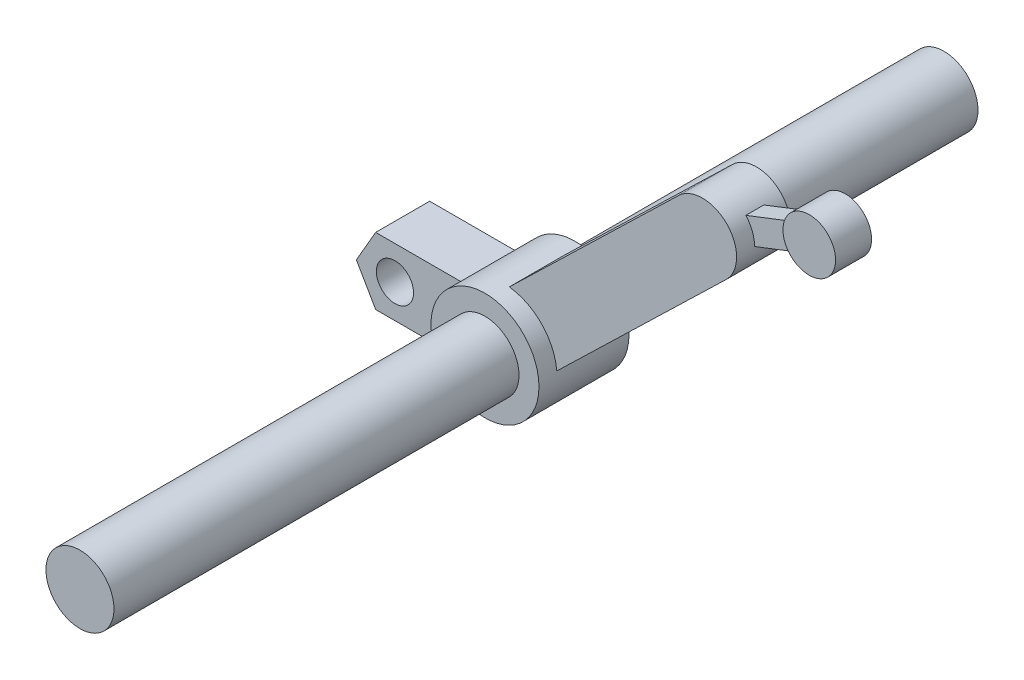
ISO-10303-21;
HEADER;
FILE_DESCRIPTION(('STEP AP214'),'2;1');
FILE_NAME('part.step','',(''),(''),'','','');
FILE_SCHEMA(('AUTOMOTIVE_DESIGN { 1 0 10303 214 1 1 1 1 }'));
ENDSEC;
DATA;
#1=APPLICATION_CONTEXT('core data for automotive mechanical design processes');
#2=APPLICATION_PROTOCOL_DEFINITION('international standard','automotive_design',2000,#1);
#3=PRODUCT_CONTEXT('',#1,'mechanical');
#4=PRODUCT('Part','Part','',(#3));
#5=PRODUCT_RELATED_PRODUCT_CATEGORY('part','',(#4));
#6=PRODUCT_DEFINITION_FORMATION('','',#4);
#7=PRODUCT_DEFINITION_CONTEXT('part definition',#1,'design');
#8=PRODUCT_DEFINITION('design','',#6,#7);
#9=PRODUCT_DEFINITION_SHAPE('','',#8);
#10=(LENGTH_UNIT() NAMED_UNIT(*) SI_UNIT(.MILLI.,.METRE.));
#11=(NAMED_UNIT(*) PLANE_ANGLE_UNIT() SI_UNIT($,.RADIAN.));
#12=(NAMED_UNIT(*) SI_UNIT($,.STERADIAN.) SOLID_ANGLE_UNIT());
#13=UNCERTAINTY_MEASURE_WITH_UNIT(LENGTH_MEASURE(1.E-05),#10,'distance_accuracy_value','');
#14=(GEOMETRIC_REPRESENTATION_CONTEXT(3) GLOBAL_UNCERTAINTY_ASSIGNED_CONTEXT((#13)) GLOBAL_UNIT_ASSIGNED_CONTEXT((#10,
#11,#12)) REPRESENTATION_CONTEXT('',''));
#15=CARTESIAN_POINT('',(0.,0.,0.));
#16=DIRECTION('',(0.,0.,1.));
#17=DIRECTION('',(1.,0.,0.));
#18=AXIS2_PLACEMENT_3D('',#15,#16,#17);
#19=CARTESIAN_POINT('',(11.3273441015259,10.0948459819858,23.5));
#20=DIRECTION('',(-0.361605144246385,0.93233133576779,0.));
#21=DIRECTION('',(-0.93233133576779,-0.361605144246385,0.));
#22=AXIS2_PLACEMENT_3D('',#19,#20,#21);
#23=PLANE('',#22);
#24=DIRECTION('',(0.,0.,-1.));
#25=VECTOR('',#24,1.);
#26=CARTESIAN_POINT('',(15.5503576142534,11.732743746268,24.));
#27=LINE('',#26,#25);
#28=CARTESIAN_POINT('',(15.5503576142534,11.732743746268,23.5));
#29=VERTEX_POINT('',#28);
#30=CARTESIAN_POINT('',(15.5503576142534,11.732743746268,22.5));
#31=VERTEX_POINT('',#30);
#32=EDGE_CURVE('E90',#29,#31,#27,.T.);
#33=ORIENTED_EDGE('',*,*,#32,.F.);
#34=DIRECTION('',(0.93233133576779,0.361605144246385,0.));
#35=VECTOR('',#34,1.);
#36=CARTESIAN_POINT('',(11.3273441015259,10.0948459819858,23.5));
#37=LINE('',#36,#35);
#38=CARTESIAN_POINT('',(12.9794699368657,10.7356237592438,23.5));
#39=VERTEX_POINT('',#38);
#40=EDGE_CURVE('E172',#39,#29,#37,.T.);
#41=ORIENTED_EDGE('',*,*,#40,.F.);
#42=DIRECTION('',(0.,0.,-1.));
#43=VECTOR('',#42,1.);
#44=CARTESIAN_POINT('',(12.9794699368657,10.7356237592438,24.5));
#45=LINE('',#44,#43);
#46=CARTESIAN_POINT('',(12.9794699368657,10.7356237592438,22.5));
#47=VERTEX_POINT('',#46);
#48=EDGE_CURVE('E282',#39,#47,#45,.T.);
#49=ORIENTED_EDGE('',*,*,#48,.T.);
#50=DIRECTION('',(0.93233133576779,0.361605144246385,0.));
#51=VECTOR('',#50,1.);
#52=CARTESIAN_POINT('',(11.3273441015259,10.0948459819858,22.5));
#53=LINE('',#52,#51);
#54=EDGE_CURVE('E173',#47,#31,#53,.T.);
#55=ORIENTED_EDGE('',*,*,#54,.T.);
#56=EDGE_LOOP('',(#33,#41,#49,#55));
#57=FACE_BOUND('',#56,.T.);
#58=ADVANCED_FACE('F66',(#57),#23,.F.);
#59=CARTESIAN_POINT('',(10.8401693064189,11.3509352127435,23.5));
#60=DIRECTION('',(-0.361605144246386,0.932331335767789,0.));
#61=DIRECTION('',(-0.93233133576779,-0.361605144246386,0.));
#62=AXIS2_PLACEMENT_3D('',#59,#60,#61);
#63=PLANE('',#62);
#64=DIRECTION('',(0.932331335767789,0.361605144246386,0.));
#65=VECTOR('',#64,1.);
#66=CARTESIAN_POINT('',(10.8401693064189,11.3509352127435,23.5));
#67=LINE('',#66,#65);
#68=CARTESIAN_POINT('',(12.4922951417588,11.9917129900015,23.5));
#69=VERTEX_POINT('',#68);
#70=CARTESIAN_POINT('',(15.0631828191465,12.9888329770257,23.5));
#71=VERTEX_POINT('',#70);
#72=EDGE_CURVE('E178',#69,#71,#67,.T.);
#73=ORIENTED_EDGE('',*,*,#72,.T.);
#74=DIRECTION('',(0.,0.,-1.));
#75=VECTOR('',#74,1.);
#76=CARTESIAN_POINT('',(15.0631828191465,12.9888329770257,24.));
#77=LINE('',#76,#75);
#78=CARTESIAN_POINT('',(15.0631828191465,12.9888329770257,22.5));
#79=VERTEX_POINT('',#78);
#80=EDGE_CURVE('E176',#71,#79,#77,.T.);
#81=ORIENTED_EDGE('',*,*,#80,.T.);
#82=DIRECTION('',(0.932331335767789,0.361605144246386,0.));
#83=VECTOR('',#82,1.);
#84=CARTESIAN_POINT('',(10.8401693064189,11.3509352127435,22.5));
#85=LINE('',#84,#83);
#86=CARTESIAN_POINT('',(12.4922951417588,11.9917129900015,22.5));
#87=VERTEX_POINT('',#86);
#88=EDGE_CURVE('E165',#87,#79,#85,.T.);
#89=ORIENTED_EDGE('',*,*,#88,.F.);
#90=DIRECTION('',(0.,0.,-1.));
#91=VECTOR('',#90,1.);
#92=CARTESIAN_POINT('',(12.4922951417588,11.9917129900015,24.5));
#93=LINE('',#92,#91);
#94=EDGE_CURVE('E280',#69,#87,#93,.T.);
#95=ORIENTED_EDGE('',*,*,#94,.F.);
#96=EDGE_LOOP('',(#73,#81,#89,#95));
#97=FACE_BOUND('',#96,.T.);
#98=ADVANCED_FACE('F177',(#97),#63,.T.);
#99=CARTESIAN_POINT('',(0.,0.,48.));
#100=DIRECTION('',(0.,0.,-1.));
#101=DIRECTION('',(-1.,0.,0.));
#102=AXIS2_PLACEMENT_3D('',#99,#100,#101);
#103=CYLINDRICAL_SURFACE('',#102,1.89);
#104=CARTESIAN_POINT('',(0.,0.,25.5));
#105=DIRECTION('',(0.,0.,1.));
#106=DIRECTION('',(1.,0.,0.));
#107=AXIS2_PLACEMENT_3D('',#104,#105,#106);
#108=CIRCLE('',#107,1.89);
#109=CARTESIAN_POINT('',(1.89,0.,25.5));
#110=VERTEX_POINT('',#109);
#111=EDGE_CURVE('E244',#110,#110,#108,.T.);
#112=ORIENTED_EDGE('',*,*,#111,.T.);
#113=EDGE_LOOP('',(#112));
#114=FACE_BOUND('',#113,.T.);
#115=CARTESIAN_POINT('',(0.,0.,48.));
#116=DIRECTION('',(0.,0.,1.));
#117=DIRECTION('',(1.,0.,0.));
#118=AXIS2_PLACEMENT_3D('',#115,#116,#117);
#119=CIRCLE('',#118,1.89);
#120=CARTESIAN_POINT('',(1.89,0.,48.));
#121=VERTEX_POINT('',#120);
#122=EDGE_CURVE('E247',#121,#121,#119,.T.);
#123=ORIENTED_EDGE('',*,*,#122,.F.);
#124=EDGE_LOOP('',(#123));
#125=FACE_BOUND('',#124,.T.);
#126=ADVANCED_FACE('F68',(#114,#125),#103,.T.);
#127=CARTESIAN_POINT('',(0.,0.,48.));
#128=DIRECTION('',(0.,0.,1.));
#129=DIRECTION('',(1.,0.,0.));
#130=AXIS2_PLACEMENT_3D('',#127,#128,#129);
#131=PLANE('',#130);
#132=ORIENTED_EDGE('',*,*,#122,.T.);
#133=EDGE_LOOP('',(#132));
#134=FACE_BOUND('',#133,.T.);
#135=ADVANCED_FACE('F359',(#134),#131,.T.);
#136=CARTESIAN_POINT('',(0.,0.,25.5));
#137=DIRECTION('',(0.,0.,-1.));
#138=DIRECTION('',(-1.,0.,0.));
#139=AXIS2_PLACEMENT_3D('',#136,#137,#138);
#140=CYLINDRICAL_SURFACE('',#139,3.);
#141=DIRECTION('',(0.,0.,-1.));
#142=VECTOR('',#141,1.);
#143=CARTESIAN_POINT('',(2.98921356890183,0.254169706088672,25.5));
#144=LINE('',#143,#142);
#145=CARTESIAN_POINT('',(2.98921356890183,0.254169706088672,24.5));
#146=VERTEX_POINT('',#145);
#147=CARTESIAN_POINT('',(2.98921356890183,0.254169706088672,21.5));
#148=VERTEX_POINT('',#147);
#149=EDGE_CURVE('E274',#146,#148,#144,.T.);
#150=ORIENTED_EDGE('',*,*,#149,.F.);
#151=CARTESIAN_POINT('',(0.,0.,24.5));
#152=DIRECTION('',(0.,0.,1.));
#153=DIRECTION('',(1.,0.,0.));
#154=AXIS2_PLACEMENT_3D('',#151,#152,#153);
#155=CIRCLE('',#154,3.);
#156=CARTESIAN_POINT('',(0.35293712278253,2.97916689484862,24.5));
#157=VERTEX_POINT('',#156);
#158=EDGE_CURVE('E277',#146,#157,#155,.T.);
#159=ORIENTED_EDGE('',*,*,#158,.T.);
#160=DIRECTION('',(0.,0.,-1.));
#161=VECTOR('',#160,1.);
#162=CARTESIAN_POINT('',(0.35293712278253,2.97916689484862,25.5));
#163=LINE('',#162,#161);
#164=CARTESIAN_POINT('',(0.35293712278253,2.97916689484862,21.5));
#165=VERTEX_POINT('',#164);
#166=EDGE_CURVE('E272',#157,#165,#163,.T.);
#167=ORIENTED_EDGE('',*,*,#166,.T.);
#168=CARTESIAN_POINT('',(0.,0.,21.5));
#169=DIRECTION('',(0.,0.,1.));
#170=DIRECTION('',(1.,0.,0.));
#171=AXIS2_PLACEMENT_3D('',#168,#169,#170);
#172=CIRCLE('',#171,3.);
#173=EDGE_CURVE('E269',#148,#165,#172,.T.);
#174=ORIENTED_EDGE('',*,*,#173,.F.);
#175=EDGE_LOOP('',(#150,#159,#167,#174));
#176=FACE_BOUND('',#175,.T.);
#177=DIRECTION('',(0.,0.,-1.));
#178=VECTOR('',#177,1.);
#179=CARTESIAN_POINT('',(-2.32978539784247,1.89,25.5));
#180=LINE('',#179,#178);
#181=CARTESIAN_POINT('',(-2.32978539784247,1.89,24.5));
#182=VERTEX_POINT('',#181);
#183=CARTESIAN_POINT('',(-2.32978539784247,1.89,21.5));
#184=VERTEX_POINT('',#183);
#185=EDGE_CURVE('E261',#182,#184,#180,.T.);
#186=ORIENTED_EDGE('',*,*,#185,.F.);
#187=CARTESIAN_POINT('',(0.,0.,24.5));
#188=DIRECTION('',(0.,0.,1.));
#189=DIRECTION('',(1.,0.,0.));
#190=AXIS2_PLACEMENT_3D('',#187,#188,#189);
#191=CIRCLE('',#190,3.);
#192=CARTESIAN_POINT('',(-2.38175973424151,-1.82406704052944,24.5));
#193=VERTEX_POINT('',#192);
#194=EDGE_CURVE('E267',#182,#193,#191,.T.);
#195=ORIENTED_EDGE('',*,*,#194,.T.);
#196=DIRECTION('',(0.,0.,-1.));
#197=VECTOR('',#196,1.);
#198=CARTESIAN_POINT('',(-2.38175973424151,-1.82406704052944,25.5));
#199=LINE('',#198,#197);
#200=CARTESIAN_POINT('',(-2.38175973424151,-1.82406704052944,21.5));
#201=VERTEX_POINT('',#200);
#202=EDGE_CURVE('E264',#201,#193,#199,.F.);
#203=ORIENTED_EDGE('',*,*,#202,.F.);
#204=CARTESIAN_POINT('',(0.,0.,21.5));
#205=DIRECTION('',(0.,0.,1.));
#206=DIRECTION('',(1.,0.,0.));
#207=AXIS2_PLACEMENT_3D('',#204,#205,#206);
#208=CIRCLE('',#207,3.);
#209=EDGE_CURVE('E256',#184,#201,#208,.T.);
#210=ORIENTED_EDGE('',*,*,#209,.F.);
#211=EDGE_LOOP('',(#186,#195,#203,#210));
#212=FACE_BOUND('',#211,.T.);
#213=CARTESIAN_POINT('',(0.,0.,25.5));
#214=DIRECTION('',(0.,0.,1.));
#215=DIRECTION('',(1.,0.,0.));
#216=AXIS2_PLACEMENT_3D('',#213,#214,#215);
#217=CIRCLE('',#216,3.);
#218=CARTESIAN_POINT('',(3.,0.,25.5));
#219=VERTEX_POINT('',#218);
#220=EDGE_CURVE('E241',#219,#219,#217,.T.);
#221=ORIENTED_EDGE('',*,*,#220,.F.);
#222=EDGE_LOOP('',(#221));
#223=FACE_BOUND('',#222,.T.);
#224=CARTESIAN_POINT('',(0.,0.,20.5));
#225=DIRECTION('',(0.,0.,1.));
#226=DIRECTION('',(1.,0.,0.));
#227=AXIS2_PLACEMENT_3D('',#224,#225,#226);
#228=CIRCLE('',#227,3.);
#229=CARTESIAN_POINT('',(3.,0.,20.5));
#230=VERTEX_POINT('',#229);
#231=EDGE_CURVE('E240',#230,#230,#228,.T.);
#232=ORIENTED_EDGE('',*,*,#231,.T.);
#233=EDGE_LOOP('',(#232));
#234=FACE_BOUND('',#233,.T.);
#235=ADVANCED_FACE('F351',(#176,#212,#223,#234),#140,.T.);
#236=CARTESIAN_POINT('',(0.,0.,25.5));
#237=DIRECTION('',(0.,0.,1.));
#238=DIRECTION('',(1.,0.,0.));
#239=AXIS2_PLACEMENT_3D('',#236,#237,#238);
#240=PLANE('',#239);
#241=ORIENTED_EDGE('',*,*,#111,.F.);
#242=EDGE_LOOP('',(#241));
#243=FACE_BOUND('',#242,.T.);
#244=ORIENTED_EDGE('',*,*,#220,.T.);
#245=EDGE_LOOP('',(#244));
#246=FACE_BOUND('',#245,.T.);
#247=ADVANCED_FACE('F347',(#243,#246),#240,.T.);
#248=CARTESIAN_POINT('',(0.,0.,20.5));
#249=DIRECTION('',(0.,0.,1.));
#250=DIRECTION('',(1.,0.,0.));
#251=AXIS2_PLACEMENT_3D('',#248,#249,#250);
#252=PLANE('',#251);
#253=CARTESIAN_POINT('',(0.,0.,20.5));
#254=DIRECTION('',(0.,0.,1.));
#255=DIRECTION('',(1.,0.,0.));
#256=AXIS2_PLACEMENT_3D('',#253,#254,#255);
#257=CIRCLE('',#256,1.89);
#258=CARTESIAN_POINT('',(1.89,0.,20.5));
#259=VERTEX_POINT('',#258);
#260=EDGE_CURVE('E250',#259,#259,#257,.T.);
#261=ORIENTED_EDGE('',*,*,#260,.T.);
#262=EDGE_LOOP('',(#261));
#263=FACE_BOUND('',#262,.T.);
#264=ORIENTED_EDGE('',*,*,#231,.F.);
#265=EDGE_LOOP('',(#264));
#266=FACE_BOUND('',#265,.T.);
#267=ADVANCED_FACE('F350',(#263,#266),#252,.F.);
#268=CARTESIAN_POINT('',(0.,0.,0.));
#269=DIRECTION('',(0.,0.,1.));
#270=DIRECTION('',(1.,0.,0.));
#271=AXIS2_PLACEMENT_3D('',#268,#269,#270);
#272=PLANE('',#271);
#273=CARTESIAN_POINT('',(0.,0.,0.));
#274=DIRECTION('',(0.,0.,1.));
#275=DIRECTION('',(1.,0.,0.));
#276=AXIS2_PLACEMENT_3D('',#273,#274,#275);
#277=CIRCLE('',#276,1.89);
#278=CARTESIAN_POINT('',(1.89,0.,0.));
#279=VERTEX_POINT('',#278);
#280=EDGE_CURVE('E251',#279,#279,#277,.T.);
#281=ORIENTED_EDGE('',*,*,#280,.F.);
#282=EDGE_LOOP('',(#281));
#283=FACE_BOUND('',#282,.T.);
#284=ADVANCED_FACE('F355',(#283),#272,.F.);
#285=ORIENTED_EDGE('',*,*,#280,.T.);
#286=EDGE_LOOP('',(#285));
#287=FACE_BOUND('',#286,.T.);
#288=ORIENTED_EDGE('',*,*,#260,.F.);
#289=EDGE_LOOP('',(#288));
#290=FACE_BOUND('',#289,.T.);
#291=ADVANCED_FACE('F342',(#287,#290),#103,.T.);
#292=CARTESIAN_POINT('',(0.,-1.82406704052944,24.5));
#293=DIRECTION('',(0.,1.,0.));
#294=DIRECTION('',(-1.,0.,0.));
#295=AXIS2_PLACEMENT_3D('',#292,#293,#294);
#296=PLANE('',#295);
#297=DIRECTION('',(1.,0.,0.));
#298=VECTOR('',#297,1.);
#299=CARTESIAN_POINT('',(0.,-1.82406704052944,21.5));
#300=LINE('',#299,#298);
#301=CARTESIAN_POINT('',(-7.072158802819,-1.82406704052944,21.5));
#302=VERTEX_POINT('',#301);
#303=EDGE_CURVE('E226',#302,#201,#300,.T.);
#304=ORIENTED_EDGE('',*,*,#303,.T.);
#305=ORIENTED_EDGE('',*,*,#202,.T.);
#306=DIRECTION('',(1.,0.,0.));
#307=VECTOR('',#306,1.);
#308=CARTESIAN_POINT('',(0.,-1.82406704052944,24.5));
#309=LINE('',#308,#307);
#310=CARTESIAN_POINT('',(-7.072158802819,-1.82406704052944,24.5));
#311=VERTEX_POINT('',#310);
#312=EDGE_CURVE('E215',#311,#193,#309,.T.);
#313=ORIENTED_EDGE('',*,*,#312,.F.);
#314=DIRECTION('',(0.,0.,-1.));
#315=VECTOR('',#314,1.);
#316=CARTESIAN_POINT('',(-7.072158802819,-1.82406704052944,24.5));
#317=LINE('',#316,#315);
#318=EDGE_CURVE('E237',#311,#302,#317,.T.);
#319=ORIENTED_EDGE('',*,*,#318,.T.);
#320=EDGE_LOOP('',(#304,#305,#313,#319));
#321=FACE_BOUND('',#320,.T.);
#322=ADVANCED_FACE('F338',(#321),#296,.F.);
#323=CARTESIAN_POINT('',(0.,1.89,24.5));
#324=DIRECTION('',(0.,-1.,0.));
#325=DIRECTION('',(1.,0.,0.));
#326=AXIS2_PLACEMENT_3D('',#323,#324,#325);
#327=PLANE('',#326);
#328=DIRECTION('',(-1.,0.,0.));
#329=VECTOR('',#328,1.);
#330=CARTESIAN_POINT('',(0.,1.89,24.5));
#331=LINE('',#330,#329);
#332=CARTESIAN_POINT('',(-7.07215880281899,1.89,24.5));
#333=VERTEX_POINT('',#332);
#334=EDGE_CURVE('E219',#182,#333,#331,.T.);
#335=ORIENTED_EDGE('',*,*,#334,.F.);
#336=ORIENTED_EDGE('',*,*,#185,.T.);
#337=DIRECTION('',(-1.,0.,0.));
#338=VECTOR('',#337,1.);
#339=CARTESIAN_POINT('',(0.,1.89,21.5));
#340=LINE('',#339,#338);
#341=CARTESIAN_POINT('',(-7.07215880281899,1.89,21.5));
#342=VERTEX_POINT('',#341);
#343=EDGE_CURVE('E229',#184,#342,#340,.T.);
#344=ORIENTED_EDGE('',*,*,#343,.T.);
#345=DIRECTION('',(0.,0.,-1.));
#346=VECTOR('',#345,1.);
#347=CARTESIAN_POINT('',(-7.07215880281899,1.89,24.5));
#348=LINE('',#347,#346);
#349=EDGE_CURVE('E234',#333,#342,#348,.T.);
#350=ORIENTED_EDGE('',*,*,#349,.F.);
#351=EDGE_LOOP('',(#335,#336,#344,#350));
#352=FACE_BOUND('',#351,.T.);
#353=ADVANCED_FACE('F335',(#352),#327,.F.);
#354=CARTESIAN_POINT('',(-6.09396329976645,-3.51835135155185,24.5));
#355=DIRECTION('',(0.866025403784439,0.5,0.));
#356=DIRECTION('',(-0.5,0.866025403784439,0.));
#357=AXIS2_PLACEMENT_3D('',#354,#355,#356);
#358=PLANE('',#357);
#359=DIRECTION('',(0.5,-0.866025403784439,0.));
#360=VECTOR('',#359,1.);
#361=CARTESIAN_POINT('',(-6.09396329976645,-3.51835135155185,21.5));
#362=LINE('',#361,#360);
#363=CARTESIAN_POINT('',(-8.14431760563799,0.0329664797352794,21.5));
#364=VERTEX_POINT('',#363);
#365=EDGE_CURVE('E211',#364,#302,#362,.T.);
#366=ORIENTED_EDGE('',*,*,#365,.T.);
#367=ORIENTED_EDGE('',*,*,#318,.F.);
#368=DIRECTION('',(0.5,-0.866025403784439,0.));
#369=VECTOR('',#368,1.);
#370=CARTESIAN_POINT('',(-6.09396329976645,-3.51835135155185,24.5));
#371=LINE('',#370,#369);
#372=CARTESIAN_POINT('',(-8.14431760563799,0.0329664797352794,24.5));
#373=VERTEX_POINT('',#372);
#374=EDGE_CURVE('E212',#373,#311,#371,.T.);
#375=ORIENTED_EDGE('',*,*,#374,.F.);
#376=DIRECTION('',(0.,0.,-1.));
#377=VECTOR('',#376,1.);
#378=CARTESIAN_POINT('',(-8.14431760563799,0.0329664797352794,24.5));
#379=LINE('',#378,#377);
#380=EDGE_CURVE('E223',#373,#364,#379,.T.);
#381=ORIENTED_EDGE('',*,*,#380,.T.);
#382=EDGE_LOOP('',(#366,#367,#375,#381));
#383=FACE_BOUND('',#382,.T.);
#384=ADVANCED_FACE('F333',(#383),#358,.F.);
#385=CARTESIAN_POINT('',(-6.12251310869054,3.5348345914195,24.5));
#386=DIRECTION('',(0.866025403784438,-0.5,0.));
#387=DIRECTION('',(0.5,0.866025403784439,0.));
#388=AXIS2_PLACEMENT_3D('',#385,#386,#387);
#389=PLANE('',#388);
#390=DIRECTION('',(-0.5,-0.866025403784439,0.));
#391=VECTOR('',#390,1.);
#392=CARTESIAN_POINT('',(-6.12251310869054,3.5348345914195,21.5));
#393=LINE('',#392,#391);
#394=EDGE_CURVE('E216',#342,#364,#393,.T.);
#395=ORIENTED_EDGE('',*,*,#394,.T.);
#396=ORIENTED_EDGE('',*,*,#380,.F.);
#397=DIRECTION('',(-0.5,-0.866025403784439,0.));
#398=VECTOR('',#397,1.);
#399=CARTESIAN_POINT('',(-6.12251310869054,3.5348345914195,24.5));
#400=LINE('',#399,#398);
#401=EDGE_CURVE('E221',#333,#373,#400,.T.);
#402=ORIENTED_EDGE('',*,*,#401,.F.);
#403=ORIENTED_EDGE('',*,*,#349,.T.);
#404=EDGE_LOOP('',(#395,#396,#402,#403));
#405=FACE_BOUND('',#404,.T.);
#406=ADVANCED_FACE('F326',(#405),#389,.F.);
#407=CARTESIAN_POINT('',(0.,0.,24.5));
#408=DIRECTION('',(0.,0.,1.));
#409=DIRECTION('',(1.,0.,0.));
#410=AXIS2_PLACEMENT_3D('',#407,#408,#409);
#411=PLANE('',#410);
#412=CARTESIAN_POINT('',(-6.,0.0329664797352796,24.5));
#413=DIRECTION('',(0.,0.,1.));
#414=DIRECTION('',(1.,0.,0.));
#415=AXIS2_PLACEMENT_3D('',#412,#413,#414);
#416=CIRCLE('',#415,1.03233065937574);
#417=CARTESIAN_POINT('',(-4.96766934062426,0.0329664797352796,24.5));
#418=VERTEX_POINT('',#417);
#419=EDGE_CURVE('E551',#418,#418,#416,.T.);
#420=ORIENTED_EDGE('',*,*,#419,.F.);
#421=EDGE_LOOP('',(#420));
#422=FACE_BOUND('',#421,.T.);
#423=ORIENTED_EDGE('',*,*,#194,.F.);
#424=ORIENTED_EDGE('',*,*,#334,.T.);
#425=ORIENTED_EDGE('',*,*,#401,.T.);
#426=ORIENTED_EDGE('',*,*,#374,.T.);
#427=ORIENTED_EDGE('',*,*,#312,.T.);
#428=EDGE_LOOP('',(#423,#424,#425,#426,#427));
#429=FACE_BOUND('',#428,.T.);
#430=ADVANCED_FACE('F323',(#422,#429),#411,.T.);
#431=CARTESIAN_POINT('',(0.,0.,21.5));
#432=DIRECTION('',(0.,0.,1.));
#433=DIRECTION('',(1.,0.,0.));
#434=AXIS2_PLACEMENT_3D('',#431,#432,#433);
#435=PLANE('',#434);
#436=CARTESIAN_POINT('',(-6.,0.0329664797352796,21.5));
#437=DIRECTION('',(0.,0.,1.));
#438=DIRECTION('',(1.,0.,0.));
#439=AXIS2_PLACEMENT_3D('',#436,#437,#438);
#440=CIRCLE('',#439,1.03233065937574);
#441=CARTESIAN_POINT('',(-4.96766934062426,0.0329664797352796,21.5));
#442=VERTEX_POINT('',#441);
#443=EDGE_CURVE('E70',#442,#442,#440,.T.);
#444=ORIENTED_EDGE('',*,*,#443,.T.);
#445=EDGE_LOOP('',(#444));
#446=FACE_BOUND('',#445,.T.);
#447=ORIENTED_EDGE('',*,*,#343,.F.);
#448=ORIENTED_EDGE('',*,*,#209,.T.);
#449=ORIENTED_EDGE('',*,*,#303,.F.);
#450=ORIENTED_EDGE('',*,*,#365,.F.);
#451=ORIENTED_EDGE('',*,*,#394,.F.);
#452=EDGE_LOOP('',(#447,#448,#449,#450,#451));
#453=FACE_BOUND('',#452,.T.);
#454=ADVANCED_FACE('F321',(#446,#453),#435,.F.);
#455=CARTESIAN_POINT('',(1.31813822305965,-1.36249859437998,24.5));
#456=DIRECTION('',(-0.695310064234418,0.718709895976346,0.));
#457=DIRECTION('',(-0.718709895976346,-0.695310064234418,0.));
#458=AXIS2_PLACEMENT_3D('',#455,#456,#457);
#459=PLANE('',#458);
#460=DIRECTION('',(0.718709895976346,0.695310064234418,0.));
#461=VECTOR('',#460,1.);
#462=CARTESIAN_POINT('',(1.31813822305965,-1.36249859437998,24.5));
#463=LINE('',#462,#461);
#464=CARTESIAN_POINT('',(12.4018949270321,9.36039200298472,24.5));
#465=VERTEX_POINT('',#464);
#466=EDGE_CURVE('E192',#146,#465,#463,.T.);
#467=ORIENTED_EDGE('',*,*,#466,.F.);
#468=ORIENTED_EDGE('',*,*,#149,.T.);
#469=DIRECTION('',(0.718709895976346,0.695310064234418,0.));
#470=VECTOR('',#469,1.);
#471=CARTESIAN_POINT('',(1.31813822305965,-1.36249859437998,21.5));
#472=LINE('',#471,#470);
#473=CARTESIAN_POINT('',(12.4018949270321,9.36039200298472,21.5));
#474=VERTEX_POINT('',#473);
#475=EDGE_CURVE('E190',#148,#474,#472,.T.);
#476=ORIENTED_EDGE('',*,*,#475,.T.);
#477=DIRECTION('',(0.,0.,-1.));
#478=VECTOR('',#477,1.);
#479=CARTESIAN_POINT('',(12.4018949270321,9.36039200298472,24.5));
#480=LINE('',#479,#478);
#481=EDGE_CURVE('E208',#465,#474,#480,.T.);
#482=ORIENTED_EDGE('',*,*,#481,.F.);
#483=EDGE_LOOP('',(#467,#468,#476,#482));
#484=FACE_BOUND('',#483,.T.);
#485=ADVANCED_FACE('F315',(#484),#459,.F.);
#486=CARTESIAN_POINT('',(-1.31813822305965,1.36249859437998,24.5));
#487=DIRECTION('',(-0.695310064234418,0.718709895976346,0.));
#488=DIRECTION('',(-0.718709895976346,-0.695310064234418,0.));
#489=AXIS2_PLACEMENT_3D('',#486,#487,#488);
#490=PLANE('',#489);
#491=ORIENTED_EDGE('',*,*,#166,.F.);
#492=DIRECTION('',(0.718709895976346,0.695310064234418,0.));
#493=VECTOR('',#492,1.);
#494=CARTESIAN_POINT('',(-1.31813822305965,1.36249859437998,24.5));
#495=LINE('',#494,#493);
#496=CARTESIAN_POINT('',(9.76561848091276,12.0853891917447,24.5));
#497=VERTEX_POINT('',#496);
#498=EDGE_CURVE('E198',#157,#497,#495,.T.);
#499=ORIENTED_EDGE('',*,*,#498,.T.);
#500=DIRECTION('',(0.,0.,-1.));
#501=VECTOR('',#500,1.);
#502=CARTESIAN_POINT('',(9.76561848091276,12.0853891917447,24.5));
#503=LINE('',#502,#501);
#504=CARTESIAN_POINT('',(9.76561848091276,12.0853891917447,21.5));
#505=VERTEX_POINT('',#504);
#506=EDGE_CURVE('E200',#497,#505,#503,.T.);
#507=ORIENTED_EDGE('',*,*,#506,.T.);
#508=DIRECTION('',(0.718709895976346,0.695310064234418,0.));
#509=VECTOR('',#508,1.);
#510=CARTESIAN_POINT('',(-1.31813822305965,1.36249859437998,21.5));
#511=LINE('',#510,#509);
#512=EDGE_CURVE('E195',#165,#505,#511,.T.);
#513=ORIENTED_EDGE('',*,*,#512,.F.);
#514=EDGE_LOOP('',(#491,#499,#507,#513));
#515=FACE_BOUND('',#514,.T.);
#516=ADVANCED_FACE('F312',(#515),#490,.T.);
#517=CARTESIAN_POINT('',(11.0837567039724,10.7228905973647,24.5));
#518=DIRECTION('',(0.,0.,-1.));
#519=DIRECTION('',(-1.,0.,0.));
#520=AXIS2_PLACEMENT_3D('',#517,#518,#519);
#521=CYLINDRICAL_SURFACE('',#520,1.8957559955802);
#522=ORIENTED_EDGE('',*,*,#48,.F.);
#523=CARTESIAN_POINT('',(11.0837567039724,10.7228905973647,23.5));
#524=DIRECTION('',(0.,0.,1.));
#525=DIRECTION('',(1.,0.,0.));
#526=AXIS2_PLACEMENT_3D('',#523,#524,#525);
#527=CIRCLE('',#526,1.8957559955802);
#528=EDGE_CURVE('E75',#39,#69,#527,.T.);
#529=ORIENTED_EDGE('',*,*,#528,.T.);
#530=ORIENTED_EDGE('',*,*,#94,.T.);
#531=CARTESIAN_POINT('',(11.0837567039724,10.7228905973647,22.5));
#532=DIRECTION('',(0.,0.,1.));
#533=DIRECTION('',(1.,0.,0.));
#534=AXIS2_PLACEMENT_3D('',#531,#532,#533);
#535=CIRCLE('',#534,1.8957559955802);
#536=EDGE_CURVE('E169',#47,#87,#535,.T.);
#537=ORIENTED_EDGE('',*,*,#536,.F.);
#538=EDGE_LOOP('',(#522,#529,#530,#537));
#539=FACE_BOUND('',#538,.T.);
#540=CARTESIAN_POINT('',(11.0837567039724,10.7228905973647,21.5));
#541=DIRECTION('',(0.,0.,1.));
#542=DIRECTION('',(1.,0.,0.));
#543=AXIS2_PLACEMENT_3D('',#540,#541,#542);
#544=CIRCLE('',#543,1.8957559955802);
#545=EDGE_CURVE('E202',#474,#505,#544,.T.);
#546=ORIENTED_EDGE('',*,*,#545,.T.);
#547=ORIENTED_EDGE('',*,*,#506,.F.);
#548=CARTESIAN_POINT('',(11.0837567039724,10.7228905973647,24.5));
#549=DIRECTION('',(0.,0.,1.));
#550=DIRECTION('',(1.,0.,0.));
#551=AXIS2_PLACEMENT_3D('',#548,#549,#550);
#552=CIRCLE('',#551,1.8957559955802);
#553=EDGE_CURVE('E194',#465,#497,#552,.T.);
#554=ORIENTED_EDGE('',*,*,#553,.F.);
#555=ORIENTED_EDGE('',*,*,#481,.T.);
#556=EDGE_LOOP('',(#546,#547,#554,#555));
#557=FACE_BOUND('',#556,.T.);
#558=ADVANCED_FACE('F287',(#539,#557),#521,.T.);
#559=CARTESIAN_POINT('',(0.,0.,24.5));
#560=DIRECTION('',(0.,0.,1.));
#561=DIRECTION('',(1.,0.,0.));
#562=AXIS2_PLACEMENT_3D('',#559,#560,#561);
#563=PLANE('',#562);
#564=ORIENTED_EDGE('',*,*,#158,.F.);
#565=ORIENTED_EDGE('',*,*,#466,.T.);
#566=ORIENTED_EDGE('',*,*,#553,.T.);
#567=ORIENTED_EDGE('',*,*,#498,.F.);
#568=EDGE_LOOP('',(#564,#565,#566,#567));
#569=FACE_BOUND('',#568,.T.);
#570=ADVANCED_FACE('F298',(#569),#563,.T.);
#571=CARTESIAN_POINT('',(0.,0.,21.5));
#572=DIRECTION('',(0.,0.,1.));
#573=DIRECTION('',(1.,0.,0.));
#574=AXIS2_PLACEMENT_3D('',#571,#572,#573);
#575=PLANE('',#574);
#576=ORIENTED_EDGE('',*,*,#475,.F.);
#577=ORIENTED_EDGE('',*,*,#173,.T.);
#578=ORIENTED_EDGE('',*,*,#512,.T.);
#579=ORIENTED_EDGE('',*,*,#545,.F.);
#580=EDGE_LOOP('',(#576,#577,#578,#579));
#581=FACE_BOUND('',#580,.T.);
#582=ADVANCED_FACE('F291',(#581),#575,.F.);
#583=CARTESIAN_POINT('',(11.0837567039724,10.7228905973647,23.5));
#584=DIRECTION('',(0.,0.,1.));
#585=DIRECTION('',(1.,0.,0.));
#586=AXIS2_PLACEMENT_3D('',#583,#584,#585);
#587=PLANE('',#586);
#588=ORIENTED_EDGE('',*,*,#40,.T.);
#589=CARTESIAN_POINT('',(16.5159713522278,12.8297775871086,23.5));
#590=DIRECTION('',(0.,0.,1.));
#591=DIRECTION('',(1.,0.,0.));
#592=AXIS2_PLACEMENT_3D('',#589,#590,#591);
#593=CIRCLE('',#592,1.46146951350828);
#594=EDGE_CURVE('E82',#29,#71,#593,.F.);
#595=ORIENTED_EDGE('',*,*,#594,.T.);
#596=ORIENTED_EDGE('',*,*,#72,.F.);
#597=ORIENTED_EDGE('',*,*,#528,.F.);
#598=EDGE_LOOP('',(#588,#595,#596,#597));
#599=FACE_BOUND('',#598,.T.);
#600=ADVANCED_FACE('F289',(#599),#587,.T.);
#601=CARTESIAN_POINT('',(11.0837567039724,10.7228905973647,22.5));
#602=DIRECTION('',(0.,0.,1.));
#603=DIRECTION('',(1.,0.,0.));
#604=AXIS2_PLACEMENT_3D('',#601,#602,#603);
#605=PLANE('',#604);
#606=CARTESIAN_POINT('',(16.5159713522278,12.8297775871086,22.5));
#607=DIRECTION('',(0.,0.,1.));
#608=DIRECTION('',(1.,0.,0.));
#609=AXIS2_PLACEMENT_3D('',#606,#607,#608);
#610=CIRCLE('',#609,1.46146951350828);
#611=EDGE_CURVE('E12',#31,#79,#610,.F.);
#612=ORIENTED_EDGE('',*,*,#611,.F.);
#613=ORIENTED_EDGE('',*,*,#54,.F.);
#614=ORIENTED_EDGE('',*,*,#536,.T.);
#615=ORIENTED_EDGE('',*,*,#88,.T.);
#616=EDGE_LOOP('',(#612,#613,#614,#615));
#617=FACE_BOUND('',#616,.T.);
#618=ADVANCED_FACE('F167',(#617),#605,.F.);
#619=CARTESIAN_POINT('',(16.5159713522278,12.8297775871086,24.));
#620=DIRECTION('',(0.,0.,-1.));
#621=DIRECTION('',(-1.,0.,0.));
#622=AXIS2_PLACEMENT_3D('',#619,#620,#621);
#623=CYLINDRICAL_SURFACE('',#622,1.46146951350828);
#624=ORIENTED_EDGE('',*,*,#594,.F.);
#625=ORIENTED_EDGE('',*,*,#32,.T.);
#626=ORIENTED_EDGE('',*,*,#611,.T.);
#627=ORIENTED_EDGE('',*,*,#80,.F.);
#628=EDGE_LOOP('',(#624,#625,#626,#627));
#629=FACE_BOUND('',#628,.T.);
#630=CARTESIAN_POINT('',(16.5159713522278,12.8297775871086,24.));
#631=DIRECTION('',(0.,0.,1.));
#632=DIRECTION('',(1.,0.,0.));
#633=AXIS2_PLACEMENT_3D('',#630,#631,#632);
#634=CIRCLE('',#633,1.46146951350828);
#635=CARTESIAN_POINT('',(17.977440865736,12.8297775871086,24.));
#636=VERTEX_POINT('',#635);
#637=EDGE_CURVE('E180',#636,#636,#634,.T.);
#638=ORIENTED_EDGE('',*,*,#637,.F.);
#639=EDGE_LOOP('',(#638));
#640=FACE_BOUND('',#639,.T.);
#641=CARTESIAN_POINT('',(16.5159713522278,12.8297775871086,22.));
#642=DIRECTION('',(0.,0.,1.));
#643=DIRECTION('',(1.,0.,0.));
#644=AXIS2_PLACEMENT_3D('',#641,#642,#643);
#645=CIRCLE('',#644,1.46146951350828);
#646=CARTESIAN_POINT('',(17.977440865736,12.8297775871086,22.));
#647=VERTEX_POINT('',#646);
#648=EDGE_CURVE('E554',#647,#647,#645,.T.);
#649=ORIENTED_EDGE('',*,*,#648,.T.);
#650=EDGE_LOOP('',(#649));
#651=FACE_BOUND('',#650,.T.);
#652=ADVANCED_FACE('F182',(#629,#640,#651),#623,.T.);
#653=CARTESIAN_POINT('',(16.5159713522278,12.8297775871086,24.));
#654=DIRECTION('',(0.,0.,1.));
#655=DIRECTION('',(1.,0.,0.));
#656=AXIS2_PLACEMENT_3D('',#653,#654,#655);
#657=PLANE('',#656);
#658=ORIENTED_EDGE('',*,*,#637,.T.);
#659=EDGE_LOOP('',(#658));
#660=FACE_BOUND('',#659,.T.);
#661=ADVANCED_FACE('F511',(#660),#657,.T.);
#662=CARTESIAN_POINT('',(16.5159713522278,12.8297775871086,22.));
#663=DIRECTION('',(0.,0.,1.));
#664=DIRECTION('',(1.,0.,0.));
#665=AXIS2_PLACEMENT_3D('',#662,#663,#664);
#666=PLANE('',#665);
#667=ORIENTED_EDGE('',*,*,#648,.F.);
#668=EDGE_LOOP('',(#667));
#669=FACE_BOUND('',#668,.T.);
#670=ADVANCED_FACE('F520',(#669),#666,.F.);
#671=CARTESIAN_POINT('',(-6.,0.0329664797352796,20.5));
#672=DIRECTION('',(0.,0.,1.));
#673=DIRECTION('',(1.,0.,0.));
#674=AXIS2_PLACEMENT_3D('',#671,#672,#673);
#675=CYLINDRICAL_SURFACE('',#674,1.03233065937574);
#676=ORIENTED_EDGE('',*,*,#419,.T.);
#677=EDGE_LOOP('',(#676));
#678=FACE_BOUND('',#677,.T.);
#679=ORIENTED_EDGE('',*,*,#443,.F.);
#680=EDGE_LOOP('',(#679));
#681=FACE_BOUND('',#680,.T.);
#682=ADVANCED_FACE('F530',(#678,#681),#675,.F.);
#683=CLOSED_SHELL('',(#58,#98,#126,#135,#235,#247,#267,#284,#291,#322,#353,#384,#406,#430,#454,
#485,#516,#558,#570,#582,#600,#618,#652,#661,#670,#682));
#684=MANIFOLD_SOLID_BREP('B2',#683);
#685=ADVANCED_BREP_SHAPE_REPRESENTATION('',(#18,#684),#14);
#686=SHAPE_DEFINITION_REPRESENTATION(#9,#685);
ENDSEC;
END-ISO-10303-21;
